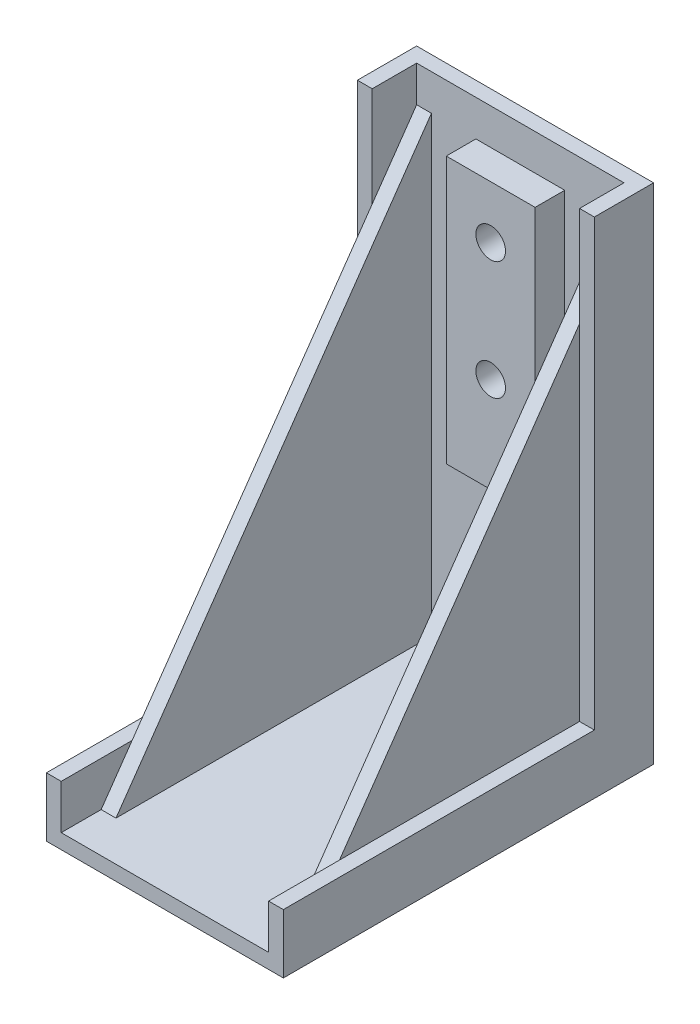
ISO-10303-21;
HEADER;
FILE_DESCRIPTION(('STEP AP214'),'2;1');
FILE_NAME('part.step','',(''),(''),'','','');
FILE_SCHEMA(('AUTOMOTIVE_DESIGN { 1 0 10303 214 1 1 1 1 }'));
ENDSEC;
DATA;
#1=APPLICATION_CONTEXT('core data for automotive mechanical design processes');
#2=APPLICATION_PROTOCOL_DEFINITION('international standard','automotive_design',2000,#1);
#3=PRODUCT_CONTEXT('',#1,'mechanical');
#4=PRODUCT('Part','Part','',(#3));
#5=PRODUCT_RELATED_PRODUCT_CATEGORY('part','',(#4));
#6=PRODUCT_DEFINITION_FORMATION('','',#4);
#7=PRODUCT_DEFINITION_CONTEXT('part definition',#1,'design');
#8=PRODUCT_DEFINITION('design','',#6,#7);
#9=PRODUCT_DEFINITION_SHAPE('','',#8);
#10=(LENGTH_UNIT() NAMED_UNIT(*) SI_UNIT(.MILLI.,.METRE.));
#11=(NAMED_UNIT(*) PLANE_ANGLE_UNIT() SI_UNIT($,.RADIAN.));
#12=(NAMED_UNIT(*) SI_UNIT($,.STERADIAN.) SOLID_ANGLE_UNIT());
#13=UNCERTAINTY_MEASURE_WITH_UNIT(LENGTH_MEASURE(1.E-05),#10,'distance_accuracy_value','');
#14=(GEOMETRIC_REPRESENTATION_CONTEXT(3) GLOBAL_UNCERTAINTY_ASSIGNED_CONTEXT((#13)) GLOBAL_UNIT_ASSIGNED_CONTEXT((#10,
#11,#12)) REPRESENTATION_CONTEXT('',''));
#15=CARTESIAN_POINT('',(0.,0.,0.));
#16=DIRECTION('',(0.,0.,1.));
#17=DIRECTION('',(1.,0.,0.));
#18=AXIS2_PLACEMENT_3D('',#15,#16,#17);
#19=CARTESIAN_POINT('',(10.,0.,-30.));
#20=DIRECTION('',(0.,0.,1.));
#21=DIRECTION('',(1.,0.,0.));
#22=AXIS2_PLACEMENT_3D('',#19,#20,#21);
#23=PLANE('',#22);
#24=DIRECTION('',(-1.,0.,0.));
#25=VECTOR('',#24,1.);
#26=CARTESIAN_POINT('',(10.,39.4565217391304,-30.));
#27=LINE('',#26,#25);
#28=CARTESIAN_POINT('',(8.75,39.4565217391304,-30.));
#29=VERTEX_POINT('',#28);
#30=CARTESIAN_POINT('',(7.5,39.4565217391304,-30.));
#31=VERTEX_POINT('',#30);
#32=EDGE_CURVE('E222',#29,#31,#27,.T.);
#33=ORIENTED_EDGE('',*,*,#32,.F.);
#34=DIRECTION('',(0.,1.,0.));
#35=VECTOR('',#34,1.);
#36=CARTESIAN_POINT('',(8.75,0.,-30.));
#37=LINE('',#36,#35);
#38=CARTESIAN_POINT('',(8.75,42.5,-30.));
#39=VERTEX_POINT('',#38);
#40=EDGE_CURVE('E255',#29,#39,#37,.T.);
#41=ORIENTED_EDGE('',*,*,#40,.T.);
#42=DIRECTION('',(-1.,0.,0.));
#43=VECTOR('',#42,1.);
#44=CARTESIAN_POINT('',(10.,42.5,-30.));
#45=LINE('',#44,#43);
#46=CARTESIAN_POINT('',(-8.75,42.5,-30.));
#47=VERTEX_POINT('',#46);
#48=EDGE_CURVE('E252',#39,#47,#45,.T.);
#49=ORIENTED_EDGE('',*,*,#48,.T.);
#50=DIRECTION('',(0.,1.,0.));
#51=VECTOR('',#50,1.);
#52=CARTESIAN_POINT('',(-8.75,0.,-30.));
#53=LINE('',#52,#51);
#54=CARTESIAN_POINT('',(-8.75,39.4565217391304,-30.));
#55=VERTEX_POINT('',#54);
#56=EDGE_CURVE('E248',#55,#47,#53,.T.);
#57=ORIENTED_EDGE('',*,*,#56,.F.);
#58=DIRECTION('',(1.,0.,0.));
#59=VECTOR('',#58,1.);
#60=CARTESIAN_POINT('',(10.,39.4565217391304,-30.));
#61=LINE('',#60,#59);
#62=CARTESIAN_POINT('',(-7.5,39.4565217391304,-30.));
#63=VERTEX_POINT('',#62);
#64=EDGE_CURVE('E233',#63,#55,#61,.F.);
#65=ORIENTED_EDGE('',*,*,#64,.F.);
#66=DIRECTION('',(0.,1.,0.));
#67=VECTOR('',#66,1.);
#68=CARTESIAN_POINT('',(-7.5,0.,-30.));
#69=LINE('',#68,#67);
#70=CARTESIAN_POINT('',(-7.5,1.25,-30.));
#71=VERTEX_POINT('',#70);
#72=EDGE_CURVE('E336',#71,#63,#69,.T.);
#73=ORIENTED_EDGE('',*,*,#72,.F.);
#74=DIRECTION('',(-1.,0.,0.));
#75=VECTOR('',#74,1.);
#76=CARTESIAN_POINT('',(10.,1.25,-30.));
#77=LINE('',#76,#75);
#78=CARTESIAN_POINT('',(7.5,1.25,-30.));
#79=VERTEX_POINT('',#78);
#80=EDGE_CURVE('E249',#79,#71,#77,.T.);
#81=ORIENTED_EDGE('',*,*,#80,.F.);
#82=DIRECTION('',(0.,-1.,0.));
#83=VECTOR('',#82,1.);
#84=CARTESIAN_POINT('',(7.5,0.,-30.));
#85=LINE('',#84,#83);
#86=EDGE_CURVE('E11',#31,#79,#85,.T.);
#87=ORIENTED_EDGE('',*,*,#86,.F.);
#88=EDGE_LOOP('',(#33,#41,#49,#57,#65,#73,#81,#87));
#89=FACE_BOUND('',#88,.T.);
#90=DIRECTION('',(1.,0.,0.));
#91=VECTOR('',#90,1.);
#92=CARTESIAN_POINT('',(-3.75,16.9565217391304,-30.));
#93=LINE('',#92,#91);
#94=CARTESIAN_POINT('',(-3.75,16.9565217391304,-30.));
#95=VERTEX_POINT('',#94);
#96=CARTESIAN_POINT('',(3.75,16.9565217391304,-30.));
#97=VERTEX_POINT('',#96);
#98=EDGE_CURVE('E691',#95,#97,#93,.T.);
#99=ORIENTED_EDGE('',*,*,#98,.F.);
#100=DIRECTION('',(0.,-1.,0.));
#101=VECTOR('',#100,1.);
#102=CARTESIAN_POINT('',(-3.75,39.4565217391304,-30.));
#103=LINE('',#102,#101);
#104=CARTESIAN_POINT('',(-3.75,39.4565217391304,-30.));
#105=VERTEX_POINT('',#104);
#106=EDGE_CURVE('E210',#105,#95,#103,.T.);
#107=ORIENTED_EDGE('',*,*,#106,.F.);
#108=DIRECTION('',(-1.,0.,0.));
#109=VECTOR('',#108,1.);
#110=CARTESIAN_POINT('',(-3.75,39.4565217391304,-30.));
#111=LINE('',#110,#109);
#112=CARTESIAN_POINT('',(3.75,39.4565217391304,-30.));
#113=VERTEX_POINT('',#112);
#114=EDGE_CURVE('E206',#113,#105,#111,.T.);
#115=ORIENTED_EDGE('',*,*,#114,.F.);
#116=DIRECTION('',(0.,1.,0.));
#117=VECTOR('',#116,1.);
#118=CARTESIAN_POINT('',(3.75,39.4565217391304,-30.));
#119=LINE('',#118,#117);
#120=EDGE_CURVE('E693',#97,#113,#119,.T.);
#121=ORIENTED_EDGE('',*,*,#120,.F.);
#122=EDGE_LOOP('',(#99,#107,#115,#121));
#123=FACE_BOUND('',#122,.T.);
#124=ADVANCED_FACE('F37',(#89,#123),#23,.T.);
#125=CARTESIAN_POINT('',(8.75,0.,0.));
#126=DIRECTION('',(1.,0.,0.));
#127=DIRECTION('',(0.,0.,-1.));
#128=AXIS2_PLACEMENT_3D('',#125,#126,#127);
#129=PLANE('',#128);
#130=DIRECTION('',(0.,0.820398166769987,-0.571792661688173));
#131=VECTOR('',#130,1.);
#132=CARTESIAN_POINT('',(8.75,0.,-2.5));
#133=LINE('',#132,#131);
#134=CARTESIAN_POINT('',(8.75,1.25,-3.37121212121212));
#135=VERTEX_POINT('',#134);
#136=CARTESIAN_POINT('',(8.75,5.,-5.98484848484849));
#137=VERTEX_POINT('',#136);
#138=EDGE_CURVE('E45',#135,#137,#133,.T.);
#139=ORIENTED_EDGE('',*,*,#138,.F.);
#140=DIRECTION('',(0.,0.,-1.));
#141=VECTOR('',#140,1.);
#142=CARTESIAN_POINT('',(8.75,1.25,0.));
#143=LINE('',#142,#141);
#144=CARTESIAN_POINT('',(8.75,1.25,0.));
#145=VERTEX_POINT('',#144);
#146=EDGE_CURVE('E253',#145,#135,#143,.T.);
#147=ORIENTED_EDGE('',*,*,#146,.F.);
#148=DIRECTION('',(0.,-1.,0.));
#149=VECTOR('',#148,1.);
#150=CARTESIAN_POINT('',(8.75,5.,0.));
#151=LINE('',#150,#149);
#152=CARTESIAN_POINT('',(8.75,5.,0.));
#153=VERTEX_POINT('',#152);
#154=EDGE_CURVE('E256',#153,#145,#151,.T.);
#155=ORIENTED_EDGE('',*,*,#154,.F.);
#156=DIRECTION('',(0.,0.,1.));
#157=VECTOR('',#156,1.);
#158=CARTESIAN_POINT('',(8.75,5.,-26.25));
#159=LINE('',#158,#157);
#160=EDGE_CURVE('E270',#137,#153,#159,.T.);
#161=ORIENTED_EDGE('',*,*,#160,.F.);
#162=EDGE_LOOP('',(#139,#147,#155,#161));
#163=FACE_BOUND('',#162,.T.);
#164=ADVANCED_FACE('F435',(#163),#129,.F.);
#165=CARTESIAN_POINT('',(8.75,34.0760869565217,-26.25));
#166=VERTEX_POINT('',#165);
#167=EDGE_CURVE('E217',#166,#29,#133,.T.);
#168=ORIENTED_EDGE('',*,*,#167,.F.);
#169=DIRECTION('',(0.,-1.,0.));
#170=VECTOR('',#169,1.);
#171=CARTESIAN_POINT('',(8.75,42.5,-26.25));
#172=LINE('',#171,#170);
#173=CARTESIAN_POINT('',(8.75,42.5,-26.25));
#174=VERTEX_POINT('',#173);
#175=EDGE_CURVE('E271',#174,#166,#172,.T.);
#176=ORIENTED_EDGE('',*,*,#175,.F.);
#177=DIRECTION('',(0.,0.,1.));
#178=VECTOR('',#177,1.);
#179=CARTESIAN_POINT('',(8.75,42.5,-31.25));
#180=LINE('',#179,#178);
#181=EDGE_CURVE('E260',#39,#174,#180,.T.);
#182=ORIENTED_EDGE('',*,*,#181,.F.);
#183=ORIENTED_EDGE('',*,*,#40,.F.);
#184=EDGE_LOOP('',(#168,#176,#182,#183));
#185=FACE_BOUND('',#184,.T.);
#186=ADVANCED_FACE('F390',(#185),#129,.F.);
#187=CARTESIAN_POINT('',(-8.75,0.,0.));
#188=DIRECTION('',(1.,0.,0.));
#189=DIRECTION('',(0.,0.,-1.));
#190=AXIS2_PLACEMENT_3D('',#187,#188,#189);
#191=PLANE('',#190);
#192=DIRECTION('',(0.,0.,-1.));
#193=VECTOR('',#192,1.);
#194=CARTESIAN_POINT('',(-8.75,1.25,0.));
#195=LINE('',#194,#193);
#196=CARTESIAN_POINT('',(-8.75,1.25,0.));
#197=VERTEX_POINT('',#196);
#198=CARTESIAN_POINT('',(-8.75,1.25,-3.37121212121212));
#199=VERTEX_POINT('',#198);
#200=EDGE_CURVE('E245',#197,#199,#195,.T.);
#201=ORIENTED_EDGE('',*,*,#200,.T.);
#202=DIRECTION('',(0.,0.820398166769987,-0.571792661688173));
#203=VECTOR('',#202,1.);
#204=CARTESIAN_POINT('',(-8.75,0.,-2.5));
#205=LINE('',#204,#203);
#206=CARTESIAN_POINT('',(-8.75,5.,-5.98484848484848));
#207=VERTEX_POINT('',#206);
#208=EDGE_CURVE('E236',#199,#207,#205,.T.);
#209=ORIENTED_EDGE('',*,*,#208,.T.);
#210=DIRECTION('',(0.,0.,1.));
#211=VECTOR('',#210,1.);
#212=CARTESIAN_POINT('',(-8.75,5.,-26.25));
#213=LINE('',#212,#211);
#214=CARTESIAN_POINT('',(-8.75,5.,0.));
#215=VERTEX_POINT('',#214);
#216=EDGE_CURVE('E284',#207,#215,#213,.T.);
#217=ORIENTED_EDGE('',*,*,#216,.T.);
#218=DIRECTION('',(0.,-1.,0.));
#219=VECTOR('',#218,1.);
#220=CARTESIAN_POINT('',(-8.75,5.,0.));
#221=LINE('',#220,#219);
#222=EDGE_CURVE('E244',#215,#197,#221,.T.);
#223=ORIENTED_EDGE('',*,*,#222,.T.);
#224=EDGE_LOOP('',(#201,#209,#217,#223));
#225=FACE_BOUND('',#224,.T.);
#226=ADVANCED_FACE('F372',(#225),#191,.T.);
#227=DIRECTION('',(0.,-1.,0.));
#228=VECTOR('',#227,1.);
#229=CARTESIAN_POINT('',(-8.75,42.5,-26.25));
#230=LINE('',#229,#228);
#231=CARTESIAN_POINT('',(-8.75,42.5,-26.25));
#232=VERTEX_POINT('',#231);
#233=CARTESIAN_POINT('',(-8.75,34.0760869565217,-26.25));
#234=VERTEX_POINT('',#233);
#235=EDGE_CURVE('E281',#232,#234,#230,.T.);
#236=ORIENTED_EDGE('',*,*,#235,.T.);
#237=EDGE_CURVE('E237',#234,#55,#205,.T.);
#238=ORIENTED_EDGE('',*,*,#237,.T.);
#239=ORIENTED_EDGE('',*,*,#56,.T.);
#240=DIRECTION('',(0.,0.,1.));
#241=VECTOR('',#240,1.);
#242=CARTESIAN_POINT('',(-8.75,42.5,-31.25));
#243=LINE('',#242,#241);
#244=EDGE_CURVE('E258',#47,#232,#243,.T.);
#245=ORIENTED_EDGE('',*,*,#244,.T.);
#246=EDGE_LOOP('',(#236,#238,#239,#245));
#247=FACE_BOUND('',#246,.T.);
#248=ADVANCED_FACE('F347',(#247),#191,.T.);
#249=CARTESIAN_POINT('',(10.,5.,0.));
#250=DIRECTION('',(0.,0.,-1.));
#251=DIRECTION('',(0.,1.,0.));
#252=AXIS2_PLACEMENT_3D('',#249,#250,#251);
#253=PLANE('',#252);
#254=ORIENTED_EDGE('',*,*,#222,.F.);
#255=DIRECTION('',(-1.,0.,0.));
#256=VECTOR('',#255,1.);
#257=CARTESIAN_POINT('',(10.,5.,0.));
#258=LINE('',#257,#256);
#259=CARTESIAN_POINT('',(-10.,5.,0.));
#260=VERTEX_POINT('',#259);
#261=EDGE_CURVE('E302',#215,#260,#258,.T.);
#262=ORIENTED_EDGE('',*,*,#261,.T.);
#263=DIRECTION('',(0.,-1.,0.));
#264=VECTOR('',#263,1.);
#265=CARTESIAN_POINT('',(-10.,5.,0.));
#266=LINE('',#265,#264);
#267=CARTESIAN_POINT('',(-10.,0.,0.));
#268=VERTEX_POINT('',#267);
#269=EDGE_CURVE('E263',#260,#268,#266,.T.);
#270=ORIENTED_EDGE('',*,*,#269,.T.);
#271=DIRECTION('',(-1.,0.,0.));
#272=VECTOR('',#271,1.);
#273=CARTESIAN_POINT('',(10.,0.,0.));
#274=LINE('',#273,#272);
#275=CARTESIAN_POINT('',(10.,0.,0.));
#276=VERTEX_POINT('',#275);
#277=EDGE_CURVE('E334',#276,#268,#274,.T.);
#278=ORIENTED_EDGE('',*,*,#277,.F.);
#279=DIRECTION('',(0.,-1.,0.));
#280=VECTOR('',#279,1.);
#281=CARTESIAN_POINT('',(10.,5.,0.));
#282=LINE('',#281,#280);
#283=CARTESIAN_POINT('',(10.,5.,0.));
#284=VERTEX_POINT('',#283);
#285=EDGE_CURVE('E288',#284,#276,#282,.T.);
#286=ORIENTED_EDGE('',*,*,#285,.F.);
#287=EDGE_CURVE('E318',#284,#153,#258,.T.);
#288=ORIENTED_EDGE('',*,*,#287,.T.);
#289=ORIENTED_EDGE('',*,*,#154,.T.);
#290=DIRECTION('',(-1.,0.,0.));
#291=VECTOR('',#290,1.);
#292=CARTESIAN_POINT('',(10.,1.25,0.));
#293=LINE('',#292,#291);
#294=EDGE_CURVE('E251',#145,#197,#293,.T.);
#295=ORIENTED_EDGE('',*,*,#294,.T.);
#296=EDGE_LOOP('',(#254,#262,#270,#278,#286,#288,#289,#295));
#297=FACE_BOUND('',#296,.T.);
#298=ADVANCED_FACE('F39',(#297),#253,.F.);
#299=CARTESIAN_POINT('',(10.,42.5,-31.25));
#300=DIRECTION('',(0.,-1.,0.));
#301=DIRECTION('',(0.,0.,-1.));
#302=AXIS2_PLACEMENT_3D('',#299,#300,#301);
#303=PLANE('',#302);
#304=ORIENTED_EDGE('',*,*,#244,.F.);
#305=ORIENTED_EDGE('',*,*,#48,.F.);
#306=ORIENTED_EDGE('',*,*,#181,.T.);
#307=DIRECTION('',(-1.,0.,0.));
#308=VECTOR('',#307,1.);
#309=CARTESIAN_POINT('',(10.,42.5,-26.25));
#310=LINE('',#309,#308);
#311=CARTESIAN_POINT('',(10.,42.5,-26.25));
#312=VERTEX_POINT('',#311);
#313=EDGE_CURVE('E326',#312,#174,#310,.T.);
#314=ORIENTED_EDGE('',*,*,#313,.F.);
#315=DIRECTION('',(0.,0.,1.));
#316=VECTOR('',#315,1.);
#317=CARTESIAN_POINT('',(10.,42.5,-31.25));
#318=LINE('',#317,#316);
#319=CARTESIAN_POINT('',(10.,42.5,-31.25));
#320=VERTEX_POINT('',#319);
#321=EDGE_CURVE('E296',#320,#312,#318,.T.);
#322=ORIENTED_EDGE('',*,*,#321,.F.);
#323=DIRECTION('',(-1.,0.,0.));
#324=VECTOR('',#323,1.);
#325=CARTESIAN_POINT('',(10.,42.5,-31.25));
#326=LINE('',#325,#324);
#327=CARTESIAN_POINT('',(-10.,42.5,-31.25));
#328=VERTEX_POINT('',#327);
#329=EDGE_CURVE('E329',#320,#328,#326,.T.);
#330=ORIENTED_EDGE('',*,*,#329,.T.);
#331=DIRECTION('',(0.,0.,1.));
#332=VECTOR('',#331,1.);
#333=CARTESIAN_POINT('',(-10.,42.5,-31.25));
#334=LINE('',#333,#332);
#335=CARTESIAN_POINT('',(-10.,42.5,-26.25));
#336=VERTEX_POINT('',#335);
#337=EDGE_CURVE('E310',#328,#336,#334,.T.);
#338=ORIENTED_EDGE('',*,*,#337,.T.);
#339=EDGE_CURVE('E325',#232,#336,#310,.T.);
#340=ORIENTED_EDGE('',*,*,#339,.F.);
#341=EDGE_LOOP('',(#304,#305,#306,#314,#322,#330,#338,#340));
#342=FACE_BOUND('',#341,.T.);
#343=ADVANCED_FACE('F360',(#342),#303,.F.);
#344=CARTESIAN_POINT('',(10.,42.5,-26.25));
#345=DIRECTION('',(0.,0.,-1.));
#346=DIRECTION('',(-1.,0.,0.));
#347=AXIS2_PLACEMENT_3D('',#344,#345,#346);
#348=PLANE('',#347);
#349=ORIENTED_EDGE('',*,*,#235,.F.);
#350=ORIENTED_EDGE('',*,*,#339,.T.);
#351=DIRECTION('',(0.,-1.,0.));
#352=VECTOR('',#351,1.);
#353=CARTESIAN_POINT('',(-10.,42.5,-26.25));
#354=LINE('',#353,#352);
#355=CARTESIAN_POINT('',(-10.,5.,-26.25));
#356=VERTEX_POINT('',#355);
#357=EDGE_CURVE('E313',#336,#356,#354,.T.);
#358=ORIENTED_EDGE('',*,*,#357,.T.);
#359=DIRECTION('',(-1.,0.,0.));
#360=VECTOR('',#359,1.);
#361=CARTESIAN_POINT('',(10.,5.,-26.25));
#362=LINE('',#361,#360);
#363=CARTESIAN_POINT('',(-8.75,5.,-26.25));
#364=VERTEX_POINT('',#363);
#365=EDGE_CURVE('E321',#364,#356,#362,.T.);
#366=ORIENTED_EDGE('',*,*,#365,.F.);
#367=EDGE_CURVE('E280',#234,#364,#230,.T.);
#368=ORIENTED_EDGE('',*,*,#367,.F.);
#369=EDGE_LOOP('',(#349,#350,#358,#366,#368));
#370=FACE_BOUND('',#369,.T.);
#371=ADVANCED_FACE('F363',(#370),#348,.F.);
#372=CARTESIAN_POINT('',(10.,5.,-26.25));
#373=DIRECTION('',(0.,-1.,0.));
#374=DIRECTION('',(0.,0.,-1.));
#375=AXIS2_PLACEMENT_3D('',#372,#373,#374);
#376=PLANE('',#375);
#377=EDGE_CURVE('E266',#364,#207,#213,.T.);
#378=ORIENTED_EDGE('',*,*,#377,.F.);
#379=ORIENTED_EDGE('',*,*,#365,.T.);
#380=DIRECTION('',(0.,0.,1.));
#381=VECTOR('',#380,1.);
#382=CARTESIAN_POINT('',(-10.,5.,-26.25));
#383=LINE('',#382,#381);
#384=EDGE_CURVE('E292',#356,#260,#383,.T.);
#385=ORIENTED_EDGE('',*,*,#384,.T.);
#386=ORIENTED_EDGE('',*,*,#261,.F.);
#387=ORIENTED_EDGE('',*,*,#216,.F.);
#388=EDGE_LOOP('',(#378,#379,#385,#386,#387));
#389=FACE_BOUND('',#388,.T.);
#390=ADVANCED_FACE('F369',(#389),#376,.F.);
#391=CARTESIAN_POINT('',(10.,0.,0.));
#392=DIRECTION('',(0.,1.,0.));
#393=DIRECTION('',(0.,0.,1.));
#394=AXIS2_PLACEMENT_3D('',#391,#392,#393);
#395=PLANE('',#394);
#396=DIRECTION('',(0.,0.,-1.));
#397=VECTOR('',#396,1.);
#398=CARTESIAN_POINT('',(-10.,0.,0.));
#399=LINE('',#398,#397);
#400=CARTESIAN_POINT('',(-10.,0.,-31.25));
#401=VERTEX_POINT('',#400);
#402=EDGE_CURVE('E305',#268,#401,#399,.T.);
#403=ORIENTED_EDGE('',*,*,#402,.T.);
#404=DIRECTION('',(-1.,0.,0.));
#405=VECTOR('',#404,1.);
#406=CARTESIAN_POINT('',(10.,0.,-31.25));
#407=LINE('',#406,#405);
#408=CARTESIAN_POINT('',(10.,0.,-31.25));
#409=VERTEX_POINT('',#408);
#410=EDGE_CURVE('E332',#409,#401,#407,.T.);
#411=ORIENTED_EDGE('',*,*,#410,.F.);
#412=DIRECTION('',(0.,0.,-1.));
#413=VECTOR('',#412,1.);
#414=CARTESIAN_POINT('',(10.,0.,0.));
#415=LINE('',#414,#413);
#416=EDGE_CURVE('E291',#276,#409,#415,.T.);
#417=ORIENTED_EDGE('',*,*,#416,.F.);
#418=ORIENTED_EDGE('',*,*,#277,.T.);
#419=EDGE_LOOP('',(#403,#411,#417,#418));
#420=FACE_BOUND('',#419,.T.);
#421=ADVANCED_FACE('F420',(#420),#395,.F.);
#422=CARTESIAN_POINT('',(10.,0.,-31.25));
#423=DIRECTION('',(0.,0.,1.));
#424=DIRECTION('',(1.,0.,0.));
#425=AXIS2_PLACEMENT_3D('',#422,#423,#424);
#426=PLANE('',#425);
#427=CARTESIAN_POINT('',(0.,35.,-31.25));
#428=DIRECTION('',(0.,0.,1.));
#429=DIRECTION('',(1.,0.,0.));
#430=AXIS2_PLACEMENT_3D('',#427,#428,#429);
#431=CIRCLE('',#430,1.25);
#432=CARTESIAN_POINT('',(1.25,35.,-31.25));
#433=VERTEX_POINT('',#432);
#434=EDGE_CURVE('E674',#433,#433,#431,.T.);
#435=ORIENTED_EDGE('',*,*,#434,.T.);
#436=EDGE_LOOP('',(#435));
#437=FACE_BOUND('',#436,.T.);
#438=CARTESIAN_POINT('',(0.,25.,-31.25));
#439=DIRECTION('',(0.,0.,1.));
#440=DIRECTION('',(1.,0.,0.));
#441=AXIS2_PLACEMENT_3D('',#438,#439,#440);
#442=CIRCLE('',#441,1.25);
#443=CARTESIAN_POINT('',(1.25,25.,-31.25));
#444=VERTEX_POINT('',#443);
#445=EDGE_CURVE('E682',#444,#444,#442,.T.);
#446=ORIENTED_EDGE('',*,*,#445,.T.);
#447=EDGE_LOOP('',(#446));
#448=FACE_BOUND('',#447,.T.);
#449=ORIENTED_EDGE('',*,*,#410,.T.);
#450=DIRECTION('',(0.,1.,0.));
#451=VECTOR('',#450,1.);
#452=CARTESIAN_POINT('',(-10.,0.,-31.25));
#453=LINE('',#452,#451);
#454=EDGE_CURVE('E308',#401,#328,#453,.T.);
#455=ORIENTED_EDGE('',*,*,#454,.T.);
#456=ORIENTED_EDGE('',*,*,#329,.F.);
#457=DIRECTION('',(0.,1.,0.));
#458=VECTOR('',#457,1.);
#459=CARTESIAN_POINT('',(10.,0.,-31.25));
#460=LINE('',#459,#458);
#461=EDGE_CURVE('E294',#409,#320,#460,.T.);
#462=ORIENTED_EDGE('',*,*,#461,.F.);
#463=EDGE_LOOP('',(#449,#455,#456,#462));
#464=FACE_BOUND('',#463,.T.);
#465=ADVANCED_FACE('F422',(#437,#448,#464),#426,.F.);
#466=ORIENTED_EDGE('',*,*,#313,.T.);
#467=ORIENTED_EDGE('',*,*,#175,.T.);
#468=CARTESIAN_POINT('',(8.75,5.,-26.25));
#469=VERTEX_POINT('',#468);
#470=EDGE_CURVE('E274',#166,#469,#172,.T.);
#471=ORIENTED_EDGE('',*,*,#470,.T.);
#472=CARTESIAN_POINT('',(10.,5.,-26.25));
#473=VERTEX_POINT('',#472);
#474=EDGE_CURVE('E322',#473,#469,#362,.T.);
#475=ORIENTED_EDGE('',*,*,#474,.F.);
#476=DIRECTION('',(0.,-1.,0.));
#477=VECTOR('',#476,1.);
#478=CARTESIAN_POINT('',(10.,42.5,-26.25));
#479=LINE('',#478,#477);
#480=EDGE_CURVE('E298',#312,#473,#479,.T.);
#481=ORIENTED_EDGE('',*,*,#480,.F.);
#482=EDGE_LOOP('',(#466,#467,#471,#475,#481));
#483=FACE_BOUND('',#482,.T.);
#484=ADVANCED_FACE('F393',(#483),#348,.F.);
#485=ORIENTED_EDGE('',*,*,#474,.T.);
#486=EDGE_CURVE('E267',#469,#137,#159,.T.);
#487=ORIENTED_EDGE('',*,*,#486,.T.);
#488=ORIENTED_EDGE('',*,*,#160,.T.);
#489=ORIENTED_EDGE('',*,*,#287,.F.);
#490=DIRECTION('',(0.,0.,1.));
#491=VECTOR('',#490,1.);
#492=CARTESIAN_POINT('',(10.,5.,-26.25));
#493=LINE('',#492,#491);
#494=EDGE_CURVE('E300',#473,#284,#493,.T.);
#495=ORIENTED_EDGE('',*,*,#494,.F.);
#496=EDGE_LOOP('',(#485,#487,#488,#489,#495));
#497=FACE_BOUND('',#496,.T.);
#498=ADVANCED_FACE('F401',(#497),#376,.F.);
#499=CARTESIAN_POINT('',(10.,0.,0.));
#500=DIRECTION('',(1.,0.,0.));
#501=DIRECTION('',(0.,0.,-1.));
#502=AXIS2_PLACEMENT_3D('',#499,#500,#501);
#503=PLANE('',#502);
#504=ORIENTED_EDGE('',*,*,#285,.T.);
#505=ORIENTED_EDGE('',*,*,#416,.T.);
#506=ORIENTED_EDGE('',*,*,#461,.T.);
#507=ORIENTED_EDGE('',*,*,#321,.T.);
#508=ORIENTED_EDGE('',*,*,#480,.T.);
#509=ORIENTED_EDGE('',*,*,#494,.T.);
#510=EDGE_LOOP('',(#504,#505,#506,#507,#508,#509));
#511=FACE_BOUND('',#510,.T.);
#512=ADVANCED_FACE('F405',(#511),#503,.T.);
#513=CARTESIAN_POINT('',(-10.,0.,0.));
#514=DIRECTION('',(1.,0.,0.));
#515=DIRECTION('',(0.,0.,-1.));
#516=AXIS2_PLACEMENT_3D('',#513,#514,#515);
#517=PLANE('',#516);
#518=ORIENTED_EDGE('',*,*,#269,.F.);
#519=ORIENTED_EDGE('',*,*,#384,.F.);
#520=ORIENTED_EDGE('',*,*,#357,.F.);
#521=ORIENTED_EDGE('',*,*,#337,.F.);
#522=ORIENTED_EDGE('',*,*,#454,.F.);
#523=ORIENTED_EDGE('',*,*,#402,.F.);
#524=EDGE_LOOP('',(#518,#519,#520,#521,#522,#523));
#525=FACE_BOUND('',#524,.T.);
#526=ADVANCED_FACE('F415',(#525),#517,.F.);
#527=CARTESIAN_POINT('',(10.,1.25,0.));
#528=DIRECTION('',(0.,1.,0.));
#529=DIRECTION('',(0.,0.,1.));
#530=AXIS2_PLACEMENT_3D('',#527,#528,#529);
#531=PLANE('',#530);
#532=DIRECTION('',(1.,0.,0.));
#533=VECTOR('',#532,1.);
#534=CARTESIAN_POINT('',(10.,1.25,-3.37121212121212));
#535=LINE('',#534,#533);
#536=CARTESIAN_POINT('',(7.5,1.25,-3.37121212121212));
#537=VERTEX_POINT('',#536);
#538=EDGE_CURVE('E60',#537,#135,#535,.T.);
#539=ORIENTED_EDGE('',*,*,#538,.F.);
#540=DIRECTION('',(0.,0.,1.));
#541=VECTOR('',#540,1.);
#542=CARTESIAN_POINT('',(7.5,1.25,0.));
#543=LINE('',#542,#541);
#544=EDGE_CURVE('E227',#79,#537,#543,.T.);
#545=ORIENTED_EDGE('',*,*,#544,.F.);
#546=ORIENTED_EDGE('',*,*,#80,.T.);
#547=DIRECTION('',(0.,0.,-1.));
#548=VECTOR('',#547,1.);
#549=CARTESIAN_POINT('',(-7.5,1.25,0.));
#550=LINE('',#549,#548);
#551=CARTESIAN_POINT('',(-7.5,1.25,-3.37121212121212));
#552=VERTEX_POINT('',#551);
#553=EDGE_CURVE('E241',#552,#71,#550,.T.);
#554=ORIENTED_EDGE('',*,*,#553,.F.);
#555=DIRECTION('',(-1.,0.,0.));
#556=VECTOR('',#555,1.);
#557=CARTESIAN_POINT('',(10.,1.25,-3.37121212121212));
#558=LINE('',#557,#556);
#559=EDGE_CURVE('E239',#199,#552,#558,.F.);
#560=ORIENTED_EDGE('',*,*,#559,.F.);
#561=ORIENTED_EDGE('',*,*,#200,.F.);
#562=ORIENTED_EDGE('',*,*,#294,.F.);
#563=ORIENTED_EDGE('',*,*,#146,.T.);
#564=EDGE_LOOP('',(#539,#545,#546,#554,#560,#561,#562,#563));
#565=FACE_BOUND('',#564,.T.);
#566=ADVANCED_FACE('F376',(#565),#531,.T.);
#567=CARTESIAN_POINT('',(-8.75,21.25,-15.625));
#568=DIRECTION('',(1.,0.,0.));
#569=DIRECTION('',(0.,0.,-1.));
#570=AXIS2_PLACEMENT_3D('',#567,#568,#569);
#571=PLANE('',#570);
#572=EDGE_CURVE('E229',#207,#234,#205,.T.);
#573=ORIENTED_EDGE('',*,*,#572,.T.);
#574=ORIENTED_EDGE('',*,*,#367,.T.);
#575=ORIENTED_EDGE('',*,*,#377,.T.);
#576=EDGE_LOOP('',(#573,#574,#575));
#577=FACE_BOUND('',#576,.T.);
#578=ADVANCED_FACE('F367',(#577),#571,.F.);
#579=CARTESIAN_POINT('',(-8.75,0.,-2.5));
#580=DIRECTION('',(0.,-0.571792661688173,-0.820398166769987));
#581=DIRECTION('',(0.,0.820398166769987,-0.571792661688173));
#582=AXIS2_PLACEMENT_3D('',#579,#580,#581);
#583=PLANE('',#582);
#584=ORIENTED_EDGE('',*,*,#208,.F.);
#585=ORIENTED_EDGE('',*,*,#559,.T.);
#586=DIRECTION('',(0.,0.820398166769987,-0.571792661688173));
#587=VECTOR('',#586,1.);
#588=CARTESIAN_POINT('',(-7.5,0.,-2.5));
#589=LINE('',#588,#587);
#590=EDGE_CURVE('E230',#552,#63,#589,.T.);
#591=ORIENTED_EDGE('',*,*,#590,.T.);
#592=ORIENTED_EDGE('',*,*,#64,.T.);
#593=ORIENTED_EDGE('',*,*,#237,.F.);
#594=ORIENTED_EDGE('',*,*,#572,.F.);
#595=EDGE_LOOP('',(#584,#585,#591,#592,#593,#594));
#596=FACE_BOUND('',#595,.T.);
#597=ADVANCED_FACE('F379',(#596),#583,.F.);
#598=CARTESIAN_POINT('',(-7.5,21.25,-15.625));
#599=DIRECTION('',(1.,0.,0.));
#600=DIRECTION('',(0.,0.,-1.));
#601=AXIS2_PLACEMENT_3D('',#598,#599,#600);
#602=PLANE('',#601);
#603=ORIENTED_EDGE('',*,*,#590,.F.);
#604=ORIENTED_EDGE('',*,*,#553,.T.);
#605=ORIENTED_EDGE('',*,*,#72,.T.);
#606=EDGE_LOOP('',(#603,#604,#605));
#607=FACE_BOUND('',#606,.T.);
#608=ADVANCED_FACE('F380',(#607),#602,.T.);
#609=CARTESIAN_POINT('',(8.75,21.25,-15.625));
#610=DIRECTION('',(-1.,0.,0.));
#611=DIRECTION('',(0.,0.,1.));
#612=AXIS2_PLACEMENT_3D('',#609,#610,#611);
#613=PLANE('',#612);
#614=ORIENTED_EDGE('',*,*,#486,.F.);
#615=ORIENTED_EDGE('',*,*,#470,.F.);
#616=EDGE_CURVE('E212',#137,#166,#133,.T.);
#617=ORIENTED_EDGE('',*,*,#616,.F.);
#618=EDGE_LOOP('',(#614,#615,#617));
#619=FACE_BOUND('',#618,.T.);
#620=ADVANCED_FACE('F399',(#619),#613,.F.);
#621=CARTESIAN_POINT('',(8.75,0.,-2.5));
#622=DIRECTION('',(0.,0.571792661688173,0.820398166769987));
#623=DIRECTION('',(0.,0.820398166769987,-0.571792661688173));
#624=AXIS2_PLACEMENT_3D('',#621,#622,#623);
#625=PLANE('',#624);
#626=DIRECTION('',(0.,0.820398166769987,-0.571792661688173));
#627=VECTOR('',#626,1.);
#628=CARTESIAN_POINT('',(7.5,0.,-2.5));
#629=LINE('',#628,#627);
#630=EDGE_CURVE('E215',#537,#31,#629,.T.);
#631=ORIENTED_EDGE('',*,*,#630,.F.);
#632=ORIENTED_EDGE('',*,*,#538,.T.);
#633=ORIENTED_EDGE('',*,*,#138,.T.);
#634=ORIENTED_EDGE('',*,*,#616,.T.);
#635=ORIENTED_EDGE('',*,*,#167,.T.);
#636=ORIENTED_EDGE('',*,*,#32,.T.);
#637=EDGE_LOOP('',(#631,#632,#633,#634,#635,#636));
#638=FACE_BOUND('',#637,.T.);
#639=ADVANCED_FACE('F386',(#638),#625,.T.);
#640=CARTESIAN_POINT('',(7.5,21.25,-15.625));
#641=DIRECTION('',(-1.,0.,0.));
#642=DIRECTION('',(0.,0.,1.));
#643=AXIS2_PLACEMENT_3D('',#640,#641,#642);
#644=PLANE('',#643);
#645=ORIENTED_EDGE('',*,*,#86,.T.);
#646=ORIENTED_EDGE('',*,*,#544,.T.);
#647=ORIENTED_EDGE('',*,*,#630,.T.);
#648=EDGE_LOOP('',(#645,#646,#647));
#649=FACE_BOUND('',#648,.T.);
#650=ADVANCED_FACE('F383',(#649),#644,.T.);
#651=CARTESIAN_POINT('',(-3.75,39.4565217391304,-27.5));
#652=DIRECTION('',(1.,0.,0.));
#653=DIRECTION('',(0.,1.,0.));
#654=AXIS2_PLACEMENT_3D('',#651,#652,#653);
#655=PLANE('',#654);
#656=ORIENTED_EDGE('',*,*,#106,.T.);
#657=DIRECTION('',(0.,0.,-1.));
#658=VECTOR('',#657,1.);
#659=CARTESIAN_POINT('',(-3.75,16.9565217391304,-27.5));
#660=LINE('',#659,#658);
#661=CARTESIAN_POINT('',(-3.75,16.9565217391304,-27.5));
#662=VERTEX_POINT('',#661);
#663=EDGE_CURVE('E191',#662,#95,#660,.T.);
#664=ORIENTED_EDGE('',*,*,#663,.F.);
#665=DIRECTION('',(0.,-1.,0.));
#666=VECTOR('',#665,1.);
#667=CARTESIAN_POINT('',(-3.75,39.4565217391304,-27.5));
#668=LINE('',#667,#666);
#669=CARTESIAN_POINT('',(-3.75,39.4565217391304,-27.5));
#670=VERTEX_POINT('',#669);
#671=EDGE_CURVE('E198',#670,#662,#668,.T.);
#672=ORIENTED_EDGE('',*,*,#671,.F.);
#673=DIRECTION('',(0.,0.,-1.));
#674=VECTOR('',#673,1.);
#675=CARTESIAN_POINT('',(-3.75,39.4565217391304,-27.5));
#676=LINE('',#675,#674);
#677=EDGE_CURVE('E689',#670,#105,#676,.T.);
#678=ORIENTED_EDGE('',*,*,#677,.T.);
#679=EDGE_LOOP('',(#656,#664,#672,#678));
#680=FACE_BOUND('',#679,.T.);
#681=ADVANCED_FACE('F208',(#680),#655,.F.);
#682=CARTESIAN_POINT('',(-3.75,16.9565217391304,-27.5));
#683=DIRECTION('',(0.,1.,0.));
#684=DIRECTION('',(0.,0.,1.));
#685=AXIS2_PLACEMENT_3D('',#682,#683,#684);
#686=PLANE('',#685);
#687=ORIENTED_EDGE('',*,*,#98,.T.);
#688=DIRECTION('',(0.,0.,-1.));
#689=VECTOR('',#688,1.);
#690=CARTESIAN_POINT('',(3.75,16.9565217391304,-27.5));
#691=LINE('',#690,#689);
#692=CARTESIAN_POINT('',(3.75,16.9565217391304,-27.5));
#693=VERTEX_POINT('',#692);
#694=EDGE_CURVE('E194',#693,#97,#691,.T.);
#695=ORIENTED_EDGE('',*,*,#694,.F.);
#696=DIRECTION('',(1.,0.,0.));
#697=VECTOR('',#696,1.);
#698=CARTESIAN_POINT('',(-3.75,16.9565217391304,-27.5));
#699=LINE('',#698,#697);
#700=EDGE_CURVE('E187',#662,#693,#699,.T.);
#701=ORIENTED_EDGE('',*,*,#700,.F.);
#702=ORIENTED_EDGE('',*,*,#663,.T.);
#703=EDGE_LOOP('',(#687,#695,#701,#702));
#704=FACE_BOUND('',#703,.T.);
#705=ADVANCED_FACE('F189',(#704),#686,.F.);
#706=CARTESIAN_POINT('',(3.75,39.4565217391304,-27.5));
#707=DIRECTION('',(-1.,0.,0.));
#708=DIRECTION('',(0.,-1.,0.));
#709=AXIS2_PLACEMENT_3D('',#706,#707,#708);
#710=PLANE('',#709);
#711=ORIENTED_EDGE('',*,*,#120,.T.);
#712=DIRECTION('',(0.,0.,-1.));
#713=VECTOR('',#712,1.);
#714=CARTESIAN_POINT('',(3.75,39.4565217391304,-27.5));
#715=LINE('',#714,#713);
#716=CARTESIAN_POINT('',(3.75,39.4565217391304,-27.5));
#717=VERTEX_POINT('',#716);
#718=EDGE_CURVE('E52',#717,#113,#715,.T.);
#719=ORIENTED_EDGE('',*,*,#718,.F.);
#720=DIRECTION('',(0.,1.,0.));
#721=VECTOR('',#720,1.);
#722=CARTESIAN_POINT('',(3.75,39.4565217391304,-27.5));
#723=LINE('',#722,#721);
#724=EDGE_CURVE('E197',#693,#717,#723,.T.);
#725=ORIENTED_EDGE('',*,*,#724,.F.);
#726=ORIENTED_EDGE('',*,*,#694,.T.);
#727=EDGE_LOOP('',(#711,#719,#725,#726));
#728=FACE_BOUND('',#727,.T.);
#729=ADVANCED_FACE('F607',(#728),#710,.F.);
#730=CARTESIAN_POINT('',(-3.75,39.4565217391304,-27.5));
#731=DIRECTION('',(0.,-1.,0.));
#732=DIRECTION('',(0.,0.,-1.));
#733=AXIS2_PLACEMENT_3D('',#730,#731,#732);
#734=PLANE('',#733);
#735=ORIENTED_EDGE('',*,*,#114,.T.);
#736=ORIENTED_EDGE('',*,*,#677,.F.);
#737=DIRECTION('',(-1.,0.,0.));
#738=VECTOR('',#737,1.);
#739=CARTESIAN_POINT('',(-3.75,39.4565217391304,-27.5));
#740=LINE('',#739,#738);
#741=EDGE_CURVE('E202',#717,#670,#740,.T.);
#742=ORIENTED_EDGE('',*,*,#741,.F.);
#743=ORIENTED_EDGE('',*,*,#718,.T.);
#744=EDGE_LOOP('',(#735,#736,#742,#743));
#745=FACE_BOUND('',#744,.T.);
#746=ADVANCED_FACE('F617',(#745),#734,.F.);
#747=CARTESIAN_POINT('',(0.,0.,-27.5));
#748=DIRECTION('',(0.,0.,1.));
#749=DIRECTION('',(1.,0.,0.));
#750=AXIS2_PLACEMENT_3D('',#747,#748,#749);
#751=PLANE('',#750);
#752=CARTESIAN_POINT('',(0.,35.,-27.5));
#753=DIRECTION('',(0.,0.,1.));
#754=DIRECTION('',(1.,0.,0.));
#755=AXIS2_PLACEMENT_3D('',#752,#753,#754);
#756=CIRCLE('',#755,1.25);
#757=CARTESIAN_POINT('',(1.25,35.,-27.5));
#758=VERTEX_POINT('',#757);
#759=EDGE_CURVE('E677',#758,#758,#756,.T.);
#760=ORIENTED_EDGE('',*,*,#759,.F.);
#761=EDGE_LOOP('',(#760));
#762=FACE_BOUND('',#761,.T.);
#763=CARTESIAN_POINT('',(0.,25.,-27.5));
#764=DIRECTION('',(0.,0.,1.));
#765=DIRECTION('',(1.,0.,0.));
#766=AXIS2_PLACEMENT_3D('',#763,#764,#765);
#767=CIRCLE('',#766,1.25);
#768=CARTESIAN_POINT('',(1.25,25.,-27.5));
#769=VERTEX_POINT('',#768);
#770=EDGE_CURVE('E678',#769,#769,#767,.T.);
#771=ORIENTED_EDGE('',*,*,#770,.F.);
#772=EDGE_LOOP('',(#771));
#773=FACE_BOUND('',#772,.T.);
#774=ORIENTED_EDGE('',*,*,#671,.T.);
#775=ORIENTED_EDGE('',*,*,#700,.T.);
#776=ORIENTED_EDGE('',*,*,#724,.T.);
#777=ORIENTED_EDGE('',*,*,#741,.T.);
#778=EDGE_LOOP('',(#774,#775,#776,#777));
#779=FACE_BOUND('',#778,.T.);
#780=ADVANCED_FACE('F201',(#762,#773,#779),#751,.T.);
#781=CARTESIAN_POINT('',(0.,25.,-31.25));
#782=DIRECTION('',(0.,0.,1.));
#783=DIRECTION('',(1.,0.,0.));
#784=AXIS2_PLACEMENT_3D('',#781,#782,#783);
#785=CYLINDRICAL_SURFACE('',#784,1.25);
#786=ORIENTED_EDGE('',*,*,#445,.F.);
#787=EDGE_LOOP('',(#786));
#788=FACE_BOUND('',#787,.T.);
#789=ORIENTED_EDGE('',*,*,#770,.T.);
#790=EDGE_LOOP('',(#789));
#791=FACE_BOUND('',#790,.T.);
#792=ADVANCED_FACE('F637',(#788,#791),#785,.F.);
#793=CARTESIAN_POINT('',(0.,35.,-31.25));
#794=DIRECTION('',(0.,0.,1.));
#795=DIRECTION('',(1.,0.,0.));
#796=AXIS2_PLACEMENT_3D('',#793,#794,#795);
#797=CYLINDRICAL_SURFACE('',#796,1.25);
#798=ORIENTED_EDGE('',*,*,#434,.F.);
#799=EDGE_LOOP('',(#798));
#800=FACE_BOUND('',#799,.T.);
#801=ORIENTED_EDGE('',*,*,#759,.T.);
#802=EDGE_LOOP('',(#801));
#803=FACE_BOUND('',#802,.T.);
#804=ADVANCED_FACE('F648',(#800,#803),#797,.F.);
#805=CLOSED_SHELL('',(#124,#164,#186,#226,#248,#298,#343,#371,#390,#421,#465,#484,#498,#512,
#526,#566,#578,#597,#608,#620,#639,#650,#681,#705,#729,#746,#780,#792,#804));
#806=MANIFOLD_SOLID_BREP('B2',#805);
#807=ADVANCED_BREP_SHAPE_REPRESENTATION('',(#18,#806),#14);
#808=SHAPE_DEFINITION_REPRESENTATION(#9,#807);
ENDSEC;
END-ISO-10303-21;
